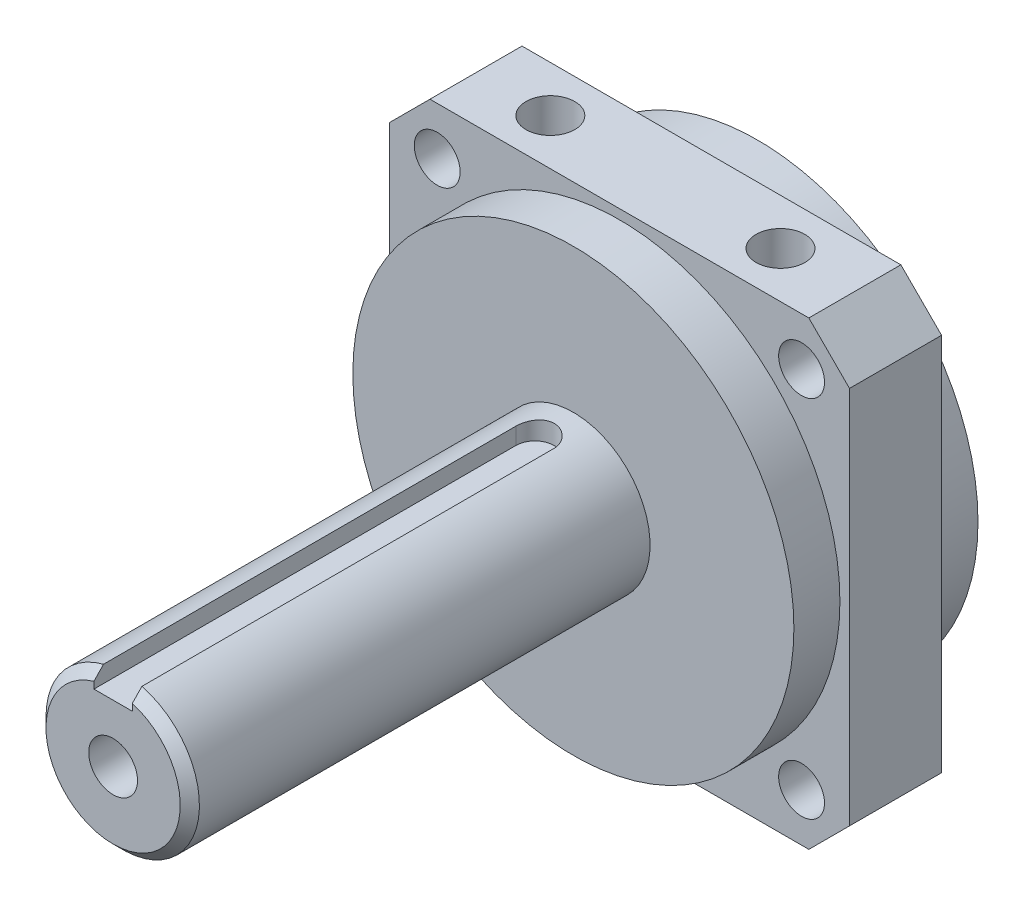
ISO-10303-21;
HEADER;
FILE_DESCRIPTION(('STEP AP214'),'2;1');
FILE_NAME('part.step','',(''),(''),'','','');
FILE_SCHEMA(('AUTOMOTIVE_DESIGN { 1 0 10303 214 1 1 1 1 }'));
ENDSEC;
DATA;
#1=APPLICATION_CONTEXT('core data for automotive mechanical design processes');
#2=APPLICATION_PROTOCOL_DEFINITION('international standard','automotive_design',2000,#1);
#3=PRODUCT_CONTEXT('',#1,'mechanical');
#4=PRODUCT('Part','Part','',(#3));
#5=PRODUCT_RELATED_PRODUCT_CATEGORY('part','',(#4));
#6=PRODUCT_DEFINITION_FORMATION('','',#4);
#7=PRODUCT_DEFINITION_CONTEXT('part definition',#1,'design');
#8=PRODUCT_DEFINITION('design','',#6,#7);
#9=PRODUCT_DEFINITION_SHAPE('','',#8);
#10=(LENGTH_UNIT() NAMED_UNIT(*) SI_UNIT(.MILLI.,.METRE.));
#11=(NAMED_UNIT(*) PLANE_ANGLE_UNIT() SI_UNIT($,.RADIAN.));
#12=(NAMED_UNIT(*) SI_UNIT($,.STERADIAN.) SOLID_ANGLE_UNIT());
#13=UNCERTAINTY_MEASURE_WITH_UNIT(LENGTH_MEASURE(1.E-05),#10,'distance_accuracy_value','');
#14=(GEOMETRIC_REPRESENTATION_CONTEXT(3) GLOBAL_UNCERTAINTY_ASSIGNED_CONTEXT((#13)) GLOBAL_UNIT_ASSIGNED_CONTEXT((#10,
#11,#12)) REPRESENTATION_CONTEXT('',''));
#15=CARTESIAN_POINT('',(0.,0.,0.));
#16=DIRECTION('',(0.,0.,1.));
#17=DIRECTION('',(1.,0.,0.));
#18=AXIS2_PLACEMENT_3D('',#15,#16,#17);
#19=CARTESIAN_POINT('',(0.,0.,28.1939999999281));
#20=DIRECTION('',(0.,0.,1.));
#21=DIRECTION('',(1.,0.,0.));
#22=AXIS2_PLACEMENT_3D('',#19,#20,#21);
#23=CONICAL_SURFACE('',#22,2.0192999998585,1.02974425866781);
#24=CARTESIAN_POINT('',(0.,0.,26.9806821519865));
#25=VERTEX_POINT('',#24);
#26=VERTEX_LOOP('',#25);
#27=FACE_BOUND('',#26,.T.);
#28=CARTESIAN_POINT('',(0.,0.,28.194));
#29=DIRECTION('',(0.,0.,1.));
#30=DIRECTION('',(1.,0.,0.));
#31=AXIS2_PLACEMENT_3D('',#28,#29,#30);
#32=CIRCLE('',#31,2.01929999999999);
#33=CARTESIAN_POINT('',(2.01929999999999,0.,28.194));
#34=VERTEX_POINT('',#33);
#35=EDGE_CURVE('E341',#34,#34,#32,.T.);
#36=ORIENTED_EDGE('',*,*,#35,.T.);
#37=EDGE_LOOP('',(#36));
#38=FACE_BOUND('',#37,.T.);
#39=ADVANCED_FACE('F16',(#27,#38),#23,.F.);
#40=CARTESIAN_POINT('',(0.,0.,38.1));
#41=DIRECTION('',(0.,0.,1.));
#42=DIRECTION('',(1.,0.,0.));
#43=AXIS2_PLACEMENT_3D('',#40,#41,#42);
#44=CYLINDRICAL_SURFACE('',#43,2.01929999999999);
#45=CARTESIAN_POINT('',(0.,0.,38.1));
#46=DIRECTION('',(0.,0.,1.));
#47=DIRECTION('',(1.,0.,0.));
#48=AXIS2_PLACEMENT_3D('',#45,#46,#47);
#49=CIRCLE('',#48,2.01929999999999);
#50=CARTESIAN_POINT('',(2.01929999999999,0.,38.1));
#51=VERTEX_POINT('',#50);
#52=EDGE_CURVE('E19',#51,#51,#49,.F.);
#53=ORIENTED_EDGE('',*,*,#52,.F.);
#54=EDGE_LOOP('',(#53));
#55=FACE_BOUND('',#54,.T.);
#56=ORIENTED_EDGE('',*,*,#35,.F.);
#57=EDGE_LOOP('',(#56));
#58=FACE_BOUND('',#57,.T.);
#59=ADVANCED_FACE('F482',(#55,#58),#44,.F.);
#60=CARTESIAN_POINT('',(-1.5875,4.7625,1.58750000000001));
#61=DIRECTION('',(0.,-1.,0.));
#62=DIRECTION('',(0.,0.,-1.));
#63=AXIS2_PLACEMENT_3D('',#60,#61,#62);
#64=PLANE('',#63);
#65=CARTESIAN_POINT('',(0.,4.7625,3.17500000000001));
#66=DIRECTION('',(0.,1.,0.));
#67=DIRECTION('',(-1.,0.,0.));
#68=AXIS2_PLACEMENT_3D('',#65,#66,#67);
#69=CIRCLE('',#68,1.5875);
#70=CARTESIAN_POINT('',(1.5875,4.7625,3.17500000000001));
#71=VERTEX_POINT('',#70);
#72=CARTESIAN_POINT('',(-1.5875,4.7625,3.17500000000001));
#73=VERTEX_POINT('',#72);
#74=EDGE_CURVE('E147',#71,#73,#69,.T.);
#75=ORIENTED_EDGE('',*,*,#74,.T.);
#76=DIRECTION('',(0.,0.,1.));
#77=VECTOR('',#76,1.);
#78=CARTESIAN_POINT('',(-1.5875,4.7625,1.58750000000001));
#79=LINE('',#78,#77);
#80=CARTESIAN_POINT('',(-1.5875,4.7625,38.1));
#81=VERTEX_POINT('',#80);
#82=EDGE_CURVE('E141',#73,#81,#79,.T.);
#83=ORIENTED_EDGE('',*,*,#82,.T.);
#84=DIRECTION('',(1.,0.,0.));
#85=VECTOR('',#84,1.);
#86=CARTESIAN_POINT('',(0.,4.7625,38.1));
#87=LINE('',#86,#85);
#88=CARTESIAN_POINT('',(1.5875,4.7625,38.1));
#89=VERTEX_POINT('',#88);
#90=EDGE_CURVE('E138',#89,#81,#87,.F.);
#91=ORIENTED_EDGE('',*,*,#90,.F.);
#92=DIRECTION('',(0.,0.,1.));
#93=VECTOR('',#92,1.);
#94=CARTESIAN_POINT('',(1.5875,4.7625,1.58750000000001));
#95=LINE('',#94,#93);
#96=EDGE_CURVE('E351',#89,#71,#95,.F.);
#97=ORIENTED_EDGE('',*,*,#96,.T.);
#98=EDGE_LOOP('',(#75,#83,#91,#97));
#99=FACE_BOUND('',#98,.T.);
#100=ADVANCED_FACE('F479',(#99),#64,.F.);
#101=CARTESIAN_POINT('',(0.,0.,38.1));
#102=DIRECTION('',(0.,0.,1.));
#103=DIRECTION('',(1.,0.,0.));
#104=AXIS2_PLACEMENT_3D('',#101,#102,#103);
#105=PLANE('',#104);
#106=DIRECTION('',(0.,1.,0.));
#107=VECTOR('',#106,1.);
#108=CARTESIAN_POINT('',(1.5875,7.9375,38.1));
#109=LINE('',#108,#107);
#110=CARTESIAN_POINT('',(1.5875,5.32463687136984,38.1000000000189));
#111=VERTEX_POINT('',#110);
#112=EDGE_CURVE('E131',#111,#89,#109,.F.);
#113=ORIENTED_EDGE('',*,*,#112,.T.);
#114=ORIENTED_EDGE('',*,*,#90,.T.);
#115=DIRECTION('',(0.,-1.,0.));
#116=VECTOR('',#115,1.);
#117=CARTESIAN_POINT('',(-1.5875,7.9375,38.1));
#118=LINE('',#117,#116);
#119=CARTESIAN_POINT('',(-1.5875,5.32463687136732,38.1000000000213));
#120=VERTEX_POINT('',#119);
#121=EDGE_CURVE('E135',#81,#120,#118,.F.);
#122=ORIENTED_EDGE('',*,*,#121,.T.);
#123=CARTESIAN_POINT('',(0.,0.,38.1000000000427));
#124=DIRECTION('',(0.,0.,-1.));
#125=DIRECTION('',(-1.,0.,0.));
#126=AXIS2_PLACEMENT_3D('',#123,#124,#125);
#127=CIRCLE('',#126,5.55624999992688);
#128=EDGE_CURVE('E119',#111,#120,#127,.T.);
#129=ORIENTED_EDGE('',*,*,#128,.F.);
#130=EDGE_LOOP('',(#113,#114,#122,#129));
#131=FACE_BOUND('',#130,.T.);
#132=ORIENTED_EDGE('',*,*,#52,.T.);
#133=EDGE_LOOP('',(#132));
#134=FACE_BOUND('',#133,.T.);
#135=ADVANCED_FACE('F136',(#131,#134),#105,.T.);
#136=CARTESIAN_POINT('',(-1.5875,7.9375,1.58750000000001));
#137=DIRECTION('',(-1.,0.,0.));
#138=DIRECTION('',(0.,-1.,0.));
#139=AXIS2_PLACEMENT_3D('',#136,#137,#138);
#140=PLANE('',#139);
#141=CARTESIAN_POINT('',(-1.5875,5.32463687139379,38.099999999996));
#142=CARTESIAN_POINT('',(-1.5875,5.46226335409388,37.9680602268335));
#143=CARTESIAN_POINT('',(-1.5875,5.5997202855016,37.8359444996539));
#144=CARTESIAN_POINT('',(-1.5875,5.87429501565907,37.5713611662396));
#145=CARTESIAN_POINT('',(-1.5875,6.01141281448309,37.4388935600819));
#146=CARTESIAN_POINT('',(-1.5875,6.14836106208903,37.3062499999843));
#147=B_SPLINE_CURVE_WITH_KNOTS('',3,(#141,#142,#143,#144,#145,#146),.UNSPECIFIED.,.F.,.F.,(4,2,
4),(0.,0.571962201759809,1.14392427822936),.UNSPECIFIED.);
#148=CARTESIAN_POINT('',(-1.5875,6.14836106209665,37.3062499999922));
#149=VERTEX_POINT('',#148);
#150=EDGE_CURVE('E123',#120,#149,#147,.T.);
#151=ORIENTED_EDGE('',*,*,#150,.F.);
#152=ORIENTED_EDGE('',*,*,#121,.F.);
#153=ORIENTED_EDGE('',*,*,#82,.F.);
#154=DIRECTION('',(0.,-1.,0.));
#155=VECTOR('',#154,1.);
#156=CARTESIAN_POINT('',(-1.5875,0.,3.17500000000001));
#157=LINE('',#156,#155);
#158=CARTESIAN_POINT('',(-1.5875,6.14836106210427,3.17500000000001));
#159=VERTEX_POINT('',#158);
#160=EDGE_CURVE('E146',#73,#159,#157,.F.);
#161=ORIENTED_EDGE('',*,*,#160,.T.);
#162=DIRECTION('',(0.,0.,-1.));
#163=VECTOR('',#162,1.);
#164=CARTESIAN_POINT('',(-1.5875,6.14836106210427,38.1));
#165=LINE('',#164,#163);
#166=EDGE_CURVE('E130',#149,#159,#165,.T.);
#167=ORIENTED_EDGE('',*,*,#166,.F.);
#168=EDGE_LOOP('',(#151,#152,#153,#161,#167));
#169=FACE_BOUND('',#168,.T.);
#170=ADVANCED_FACE('F143',(#169),#140,.F.);
#171=CARTESIAN_POINT('',(0.,0.,3.17500000000001));
#172=DIRECTION('',(0.,1.,0.));
#173=DIRECTION('',(-1.,0.,0.));
#174=AXIS2_PLACEMENT_3D('',#171,#172,#173);
#175=CYLINDRICAL_SURFACE('',#174,1.5875);
#176=DIRECTION('',(0.,1.,0.));
#177=VECTOR('',#176,1.);
#178=CARTESIAN_POINT('',(1.5875,7.9375,3.17500000000001));
#179=LINE('',#178,#177);
#180=CARTESIAN_POINT('',(1.5875,6.14836106210428,3.17500000000001));
#181=VERTEX_POINT('',#180);
#182=EDGE_CURVE('E174',#71,#181,#179,.T.);
#183=ORIENTED_EDGE('',*,*,#182,.T.);
#184=CARTESIAN_POINT('',(-1.5875,6.14836106210427,3.17500000000002));
#185=CARTESIAN_POINT('',(-1.5875005347221,6.14835810868573,3.13108504800574));
#186=CARTESIAN_POINT('',(-1.58567661174546,6.1488321571389,3.08719185612077));
#187=CARTESIAN_POINT('',(-1.57840569717735,6.15070373440419,2.99973374007765));
#188=CARTESIAN_POINT('',(-1.57295931521448,6.15210110782842,2.95616876193135));
#189=CARTESIAN_POINT('',(-1.55126572658893,6.1576221525004,2.82661823019265));
#190=CARTESIAN_POINT('',(-1.5296637296004,6.16307509376748,2.74152292592806));
#191=CARTESIAN_POINT('',(-1.47287895457943,6.17688995608206,2.5763131201806));
#192=CARTESIAN_POINT('',(-1.43769722409702,6.18525165274125,2.4961982350581));
#193=CARTESIAN_POINT('',(-1.35479517756304,6.20393662510198,2.34297047529258));
#194=CARTESIAN_POINT('',(-1.30707194181757,6.21426035741522,2.26985923653114));
#195=CARTESIAN_POINT('',(-1.1993371670561,6.23595707887749,2.13115606527995));
#196=CARTESIAN_POINT('',(-1.13910300733152,6.24734667388768,2.06573970062098));
#197=CARTESIAN_POINT('',(-1.00851371119878,6.26975132963679,1.94580623088578));
#198=CARTESIAN_POINT('',(-0.938154957437526,6.28076625476574,1.8912930380437));
#199=CARTESIAN_POINT('',(-0.78808953580411,6.30136714833112,1.79399185375318));
#200=CARTESIAN_POINT('',(-0.708263180753414,6.31093033514495,1.75138340439519));
#201=CARTESIAN_POINT('',(-0.542357177260244,6.32734283789911,1.6802996564682));
#202=CARTESIAN_POINT('',(-0.456285166695517,6.33419540463604,1.65180741816498));
#203=CARTESIAN_POINT('',(-0.308152380307649,6.34280690605921,1.61646213932074));
#204=CARTESIAN_POINT('',(-0.247067257357066,6.34549035539136,1.60562005304944));
#205=CARTESIAN_POINT('',(-0.123996454410237,6.3490876888745,1.59113769145861));
#206=CARTESIAN_POINT('',(-0.0620107875572763,6.35000159882553,1.58749731113757));
#207=CARTESIAN_POINT('',(0.0876803967486354,6.34999773933436,1.58750380192762));
#208=CARTESIAN_POINT('',(0.175411016460152,6.34816513335973,1.594791067172));
#209=CARTESIAN_POINT('',(0.348380525034637,6.34102879138945,1.62371289354695));
#210=CARTESIAN_POINT('',(0.433616958406108,6.33572174751383,1.64536112746986));
#211=CARTESIAN_POINT('',(0.599040292949523,6.32222512421158,1.70226580793548));
#212=CARTESIAN_POINT('',(0.679233912557768,6.3140394800964,1.7375036825137));
#213=CARTESIAN_POINT('',(0.832565934999531,6.29565763049597,1.82052815492061));
#214=CARTESIAN_POINT('',(0.905704517218626,6.28546147615122,1.86831443357106));
#215=CARTESIAN_POINT('',(1.04436365780342,6.26393038121457,1.97611942379249));
#216=CARTESIAN_POINT('',(1.10971829889362,6.25257786624043,2.03634803202077));
#217=CARTESIAN_POINT('',(1.22951519838159,6.2301296384948,2.16688424756393));
#218=CARTESIAN_POINT('',(1.28395571935549,6.21903396685861,2.23719345656366));
#219=CARTESIAN_POINT('',(1.38116725538388,6.19817668389332,2.38719176796676));
#220=CARTESIAN_POINT('',(1.42374920363026,6.18843780250452,2.46700671760337));
#221=CARTESIAN_POINT('',(1.49480507045921,6.17166094046039,2.63292689704295));
#222=CARTESIAN_POINT('',(1.52328958149317,6.16462093284005,2.71902734809052));
#223=CARTESIAN_POINT('',(1.55859647860432,6.15576956135878,2.86715803226458));
#224=CARTESIAN_POINT('',(1.5694184144922,6.15300921691422,2.92820781192755));
#225=CARTESIAN_POINT('',(1.58387467718142,6.14929718216966,3.05116074651233));
#226=CARTESIAN_POINT('',(1.58751418051883,6.14834418929123,3.11306325442812));
#227=CARTESIAN_POINT('',(1.5875,6.14836106210428,3.17500000000001));
#228=B_SPLINE_CURVE_WITH_KNOTS('',3,(#184,#185,#186,#187,#188,#189,#190,#191,#192,#193,#194,
#195,#196,#197,#198,#199,#200,#201,#202,#203,#204,#205,#206,#207,#208,#209,#210,#211,#212,#213,
#214,#215,#216,#217,#218,#219,#220,#221,#222,#223,#224,#225,#226,#227),.UNSPECIFIED.,.F.,.F.,(4,
2,2,2,2,2,2,2,2,2,2,2,2,2,2,2,2,2,2,2,2,4),(0.,0.131661631551339,0.26330111119063,
0.525827565802087,0.788333772987209,1.05090114649685,1.31861744482507,1.58642963242961,
1.85808613315677,2.12941584627081,2.31528840630699,2.50115825628429,2.76396966106715,
3.02703164315824,3.28973538447958,3.5524324443777,3.81998818241836,4.08758647901983,
4.35923443864542,4.63067797793238,4.81644389573702,5.00207587901888),.UNSPECIFIED.);
#229=EDGE_CURVE('E176',#159,#181,#228,.T.);
#230=ORIENTED_EDGE('',*,*,#229,.F.);
#231=ORIENTED_EDGE('',*,*,#160,.F.);
#232=ORIENTED_EDGE('',*,*,#74,.F.);
#233=EDGE_LOOP('',(#183,#230,#231,#232));
#234=FACE_BOUND('',#233,.T.);
#235=ADVANCED_FACE('F186',(#234),#175,.F.);
#236=CARTESIAN_POINT('',(1.5875,7.9375,1.58750000000001));
#237=DIRECTION('',(1.,0.,0.));
#238=DIRECTION('',(0.,1.,0.));
#239=AXIS2_PLACEMENT_3D('',#236,#237,#238);
#240=PLANE('',#239);
#241=CARTESIAN_POINT('',(1.5875,6.14836106208903,37.3062499999843));
#242=CARTESIAN_POINT('',(1.5875,6.01141281448322,37.4388935600818));
#243=CARTESIAN_POINT('',(1.5875,5.87429501565934,37.5713611662393));
#244=CARTESIAN_POINT('',(1.5875,5.59972028550214,37.8359444996534));
#245=CARTESIAN_POINT('',(1.5875,5.46226335409455,37.9680602268328));
#246=CARTESIAN_POINT('',(1.5875,5.3246368713946,38.0999999999952));
#247=B_SPLINE_CURVE_WITH_KNOTS('',3,(#241,#242,#243,#244,#245,#246),.UNSPECIFIED.,.F.,.F.,(4,2,
4),(0.,0.571962076468992,1.14392427822824),.UNSPECIFIED.);
#248=CARTESIAN_POINT('',(1.5875,6.14836106209665,37.3062499999922));
#249=VERTEX_POINT('',#248);
#250=EDGE_CURVE('E126',#249,#111,#247,.T.);
#251=ORIENTED_EDGE('',*,*,#250,.F.);
#252=DIRECTION('',(0.,0.,-1.));
#253=VECTOR('',#252,1.);
#254=CARTESIAN_POINT('',(1.5875,6.14836106210428,38.1));
#255=LINE('',#254,#253);
#256=EDGE_CURVE('E183',#181,#249,#255,.F.);
#257=ORIENTED_EDGE('',*,*,#256,.F.);
#258=ORIENTED_EDGE('',*,*,#182,.F.);
#259=ORIENTED_EDGE('',*,*,#96,.F.);
#260=ORIENTED_EDGE('',*,*,#112,.F.);
#261=EDGE_LOOP('',(#251,#257,#258,#259,#260));
#262=FACE_BOUND('',#261,.T.);
#263=ADVANCED_FACE('F165',(#262),#240,.F.);
#264=CARTESIAN_POINT('',(0.,0.,37.3062500001424));
#265=DIRECTION('',(0.,0.,-1.));
#266=DIRECTION('',(-1.,0.,0.));
#267=AXIS2_PLACEMENT_3D('',#264,#265,#266);
#268=CONICAL_SURFACE('',#267,6.34999999982711,0.785398163397448);
#269=ORIENTED_EDGE('',*,*,#128,.T.);
#270=ORIENTED_EDGE('',*,*,#150,.T.);
#271=CARTESIAN_POINT('',(0.,0.,37.30625));
#272=DIRECTION('',(0.,0.,-1.));
#273=DIRECTION('',(-1.,0.,0.));
#274=AXIS2_PLACEMENT_3D('',#271,#272,#273);
#275=CIRCLE('',#274,6.35);
#276=EDGE_CURVE('E298',#249,#149,#275,.T.);
#277=ORIENTED_EDGE('',*,*,#276,.F.);
#278=ORIENTED_EDGE('',*,*,#250,.T.);
#279=EDGE_LOOP('',(#269,#270,#277,#278));
#280=FACE_BOUND('',#279,.T.);
#281=ADVANCED_FACE('F121',(#280),#268,.T.);
#282=CARTESIAN_POINT('',(0.,0.,38.1));
#283=DIRECTION('',(0.,0.,-1.));
#284=DIRECTION('',(-1.,0.,0.));
#285=AXIS2_PLACEMENT_3D('',#282,#283,#284);
#286=CYLINDRICAL_SURFACE('',#285,6.35);
#287=ORIENTED_EDGE('',*,*,#256,.T.);
#288=ORIENTED_EDGE('',*,*,#276,.T.);
#289=ORIENTED_EDGE('',*,*,#166,.T.);
#290=ORIENTED_EDGE('',*,*,#229,.T.);
#291=EDGE_LOOP('',(#287,#288,#289,#290));
#292=FACE_BOUND('',#291,.T.);
#293=CARTESIAN_POINT('',(0.,0.,0.));
#294=DIRECTION('',(0.,0.,-1.));
#295=DIRECTION('',(-1.,0.,0.));
#296=AXIS2_PLACEMENT_3D('',#293,#294,#295);
#297=CIRCLE('',#296,6.35);
#298=CARTESIAN_POINT('',(-6.35,0.,0.));
#299=VERTEX_POINT('',#298);
#300=EDGE_CURVE('E184',#299,#299,#297,.F.);
#301=ORIENTED_EDGE('',*,*,#300,.T.);
#302=EDGE_LOOP('',(#301));
#303=FACE_BOUND('',#302,.T.);
#304=ADVANCED_FACE('F164',(#292,#303),#286,.T.);
#305=CARTESIAN_POINT('',(0.,0.,0.));
#306=DIRECTION('',(0.,0.,-1.));
#307=DIRECTION('',(-1.,0.,0.));
#308=AXIS2_PLACEMENT_3D('',#305,#306,#307);
#309=PLANE('',#308);
#310=ORIENTED_EDGE('',*,*,#300,.F.);
#311=EDGE_LOOP('',(#310));
#312=FACE_BOUND('',#311,.T.);
#313=CARTESIAN_POINT('',(0.,0.,0.));
#314=DIRECTION('',(0.,0.,1.));
#315=DIRECTION('',(1.,0.,0.));
#316=AXIS2_PLACEMENT_3D('',#313,#314,#315);
#317=CIRCLE('',#316,18.25625);
#318=CARTESIAN_POINT('',(18.25625,0.,0.));
#319=VERTEX_POINT('',#318);
#320=EDGE_CURVE('E293',#319,#319,#317,.F.);
#321=ORIENTED_EDGE('',*,*,#320,.F.);
#322=EDGE_LOOP('',(#321));
#323=FACE_BOUND('',#322,.T.);
#324=ADVANCED_FACE('F280',(#312,#323),#309,.F.);
#325=CARTESIAN_POINT('',(9.525,11.4300000000185,-7.62));
#326=DIRECTION('',(0.,1.,0.));
#327=DIRECTION('',(0.,0.,1.));
#328=AXIS2_PLACEMENT_3D('',#325,#326,#327);
#329=CONICAL_SURFACE('',#328,2.01930000005461,1.02974425868441);
#330=CARTESIAN_POINT('',(9.525,10.2166821519916,-7.62000000005684));
#331=VERTEX_POINT('',#330);
#332=VERTEX_LOOP('',#331);
#333=FACE_BOUND('',#332,.T.);
#334=CARTESIAN_POINT('',(9.525,11.43,-7.62));
#335=DIRECTION('',(0.,1.,0.));
#336=DIRECTION('',(0.,0.,1.));
#337=AXIS2_PLACEMENT_3D('',#334,#335,#336);
#338=CIRCLE('',#337,2.01929999999999);
#339=CARTESIAN_POINT('',(9.525,11.43,-5.60070000000001));
#340=VERTEX_POINT('',#339);
#341=EDGE_CURVE('E294',#340,#340,#338,.T.);
#342=ORIENTED_EDGE('',*,*,#341,.T.);
#343=EDGE_LOOP('',(#342));
#344=FACE_BOUND('',#343,.T.);
#345=ADVANCED_FACE('F277',(#333,#344),#329,.F.);
#346=CARTESIAN_POINT('',(-9.525,11.4300000000753,-7.62));
#347=DIRECTION('',(0.,1.,0.));
#348=DIRECTION('',(0.,0.,1.));
#349=AXIS2_PLACEMENT_3D('',#346,#347,#348);
#350=CONICAL_SURFACE('',#349,2.01930000011145,1.02974425867615);
#351=CARTESIAN_POINT('',(-9.525,10.2166821519916,-7.62000000005969));
#352=VERTEX_POINT('',#351);
#353=VERTEX_LOOP('',#352);
#354=FACE_BOUND('',#353,.T.);
#355=CARTESIAN_POINT('',(-9.525,11.43,-7.62));
#356=DIRECTION('',(0.,1.,0.));
#357=DIRECTION('',(0.,0.,1.));
#358=AXIS2_PLACEMENT_3D('',#355,#356,#357);
#359=CIRCLE('',#358,2.01929999999999);
#360=CARTESIAN_POINT('',(-9.525,11.43,-5.60070000000001));
#361=VERTEX_POINT('',#360);
#362=EDGE_CURVE('E296',#361,#361,#359,.T.);
#363=ORIENTED_EDGE('',*,*,#362,.T.);
#364=EDGE_LOOP('',(#363));
#365=FACE_BOUND('',#364,.T.);
#366=ADVANCED_FACE('F273',(#354,#365),#350,.F.);
#367=CARTESIAN_POINT('',(0.,0.,-3.81));
#368=DIRECTION('',(0.,0.,1.));
#369=DIRECTION('',(1.,0.,0.));
#370=AXIS2_PLACEMENT_3D('',#367,#368,#369);
#371=CYLINDRICAL_SURFACE('',#370,18.25625);
#372=ORIENTED_EDGE('',*,*,#320,.T.);
#373=EDGE_LOOP('',(#372));
#374=FACE_BOUND('',#373,.T.);
#375=CARTESIAN_POINT('',(0.,0.,-3.81));
#376=DIRECTION('',(0.,0.,1.));
#377=DIRECTION('',(1.,0.,0.));
#378=AXIS2_PLACEMENT_3D('',#375,#376,#377);
#379=CIRCLE('',#378,18.25625);
#380=CARTESIAN_POINT('',(18.25625,0.,-3.81));
#381=VERTEX_POINT('',#380);
#382=EDGE_CURVE('E300',#381,#381,#379,.T.);
#383=ORIENTED_EDGE('',*,*,#382,.T.);
#384=EDGE_LOOP('',(#383));
#385=FACE_BOUND('',#384,.T.);
#386=ADVANCED_FACE('F269',(#374,#385),#371,.T.);
#387=CARTESIAN_POINT('',(9.525,19.05,-7.62));
#388=DIRECTION('',(0.,1.,0.));
#389=DIRECTION('',(0.,0.,1.));
#390=AXIS2_PLACEMENT_3D('',#387,#388,#389);
#391=CYLINDRICAL_SURFACE('',#390,2.01929999999999);
#392=CARTESIAN_POINT('',(9.525,19.05,-7.62));
#393=DIRECTION('',(0.,1.,0.));
#394=DIRECTION('',(0.,0.,1.));
#395=AXIS2_PLACEMENT_3D('',#392,#393,#394);
#396=CIRCLE('',#395,2.01929999999999);
#397=CARTESIAN_POINT('',(9.525,19.05,-5.60070000000001));
#398=VERTEX_POINT('',#397);
#399=EDGE_CURVE('E316',#398,#398,#396,.F.);
#400=ORIENTED_EDGE('',*,*,#399,.F.);
#401=EDGE_LOOP('',(#400));
#402=FACE_BOUND('',#401,.T.);
#403=ORIENTED_EDGE('',*,*,#341,.F.);
#404=EDGE_LOOP('',(#403));
#405=FACE_BOUND('',#404,.T.);
#406=ADVANCED_FACE('F265',(#402,#405),#391,.F.);
#407=CARTESIAN_POINT('',(-9.525,19.05,-7.62));
#408=DIRECTION('',(0.,1.,0.));
#409=DIRECTION('',(0.,0.,1.));
#410=AXIS2_PLACEMENT_3D('',#407,#408,#409);
#411=CYLINDRICAL_SURFACE('',#410,2.01929999999999);
#412=CARTESIAN_POINT('',(-9.525,19.05,-7.62));
#413=DIRECTION('',(0.,1.,0.));
#414=DIRECTION('',(0.,0.,1.));
#415=AXIS2_PLACEMENT_3D('',#412,#413,#414);
#416=CIRCLE('',#415,2.01929999999999);
#417=CARTESIAN_POINT('',(-9.525,19.05,-5.60070000000001));
#418=VERTEX_POINT('',#417);
#419=EDGE_CURVE('E319',#418,#418,#416,.F.);
#420=ORIENTED_EDGE('',*,*,#419,.F.);
#421=EDGE_LOOP('',(#420));
#422=FACE_BOUND('',#421,.T.);
#423=ORIENTED_EDGE('',*,*,#362,.F.);
#424=EDGE_LOOP('',(#423));
#425=FACE_BOUND('',#424,.T.);
#426=ADVANCED_FACE('F261',(#422,#425),#411,.F.);
#427=CARTESIAN_POINT('',(0.,0.,-3.81));
#428=DIRECTION('',(0.,0.,-1.));
#429=DIRECTION('',(-1.,0.,0.));
#430=AXIS2_PLACEMENT_3D('',#427,#428,#429);
#431=PLANE('',#430);
#432=DIRECTION('',(1.,0.,0.));
#433=VECTOR('',#432,1.);
#434=CARTESIAN_POINT('',(-19.05,-19.05,-3.81));
#435=LINE('',#434,#433);
#436=CARTESIAN_POINT('',(15.6824039545991,-19.05,-3.81));
#437=VERTEX_POINT('',#436);
#438=CARTESIAN_POINT('',(-15.6824039545991,-19.05,-3.81));
#439=VERTEX_POINT('',#438);
#440=EDGE_CURVE('E315',#437,#439,#435,.F.);
#441=ORIENTED_EDGE('',*,*,#440,.F.);
#442=DIRECTION('',(-0.707106781186543,-0.707106781186552,0.));
#443=VECTOR('',#442,1.);
#444=CARTESIAN_POINT('',(19.05,-15.682403954599,-3.81));
#445=LINE('',#444,#443);
#446=CARTESIAN_POINT('',(19.05,-15.682403954599,-3.81));
#447=VERTEX_POINT('',#446);
#448=EDGE_CURVE('E372',#437,#447,#445,.F.);
#449=ORIENTED_EDGE('',*,*,#448,.T.);
#450=DIRECTION('',(0.,1.,0.));
#451=VECTOR('',#450,1.);
#452=CARTESIAN_POINT('',(19.05,-19.05,-3.81));
#453=LINE('',#452,#451);
#454=CARTESIAN_POINT('',(19.05,15.682403954599,-3.81));
#455=VERTEX_POINT('',#454);
#456=EDGE_CURVE('E377',#455,#447,#453,.F.);
#457=ORIENTED_EDGE('',*,*,#456,.F.);
#458=DIRECTION('',(-0.707106781186543,0.707106781186552,0.));
#459=VECTOR('',#458,1.);
#460=CARTESIAN_POINT('',(19.05,15.682403954599,-3.81));
#461=LINE('',#460,#459);
#462=CARTESIAN_POINT('',(15.6824039545991,19.05,-3.81));
#463=VERTEX_POINT('',#462);
#464=EDGE_CURVE('E380',#463,#455,#461,.F.);
#465=ORIENTED_EDGE('',*,*,#464,.F.);
#466=DIRECTION('',(1.,0.,0.));
#467=VECTOR('',#466,1.);
#468=CARTESIAN_POINT('',(-19.05,19.05,-3.81));
#469=LINE('',#468,#467);
#470=CARTESIAN_POINT('',(-15.6824039545991,19.05,-3.81));
#471=VERTEX_POINT('',#470);
#472=EDGE_CURVE('E323',#471,#463,#469,.T.);
#473=ORIENTED_EDGE('',*,*,#472,.F.);
#474=DIRECTION('',(0.707106781186543,0.707106781186552,0.));
#475=VECTOR('',#474,1.);
#476=CARTESIAN_POINT('',(-19.05,15.682403954599,-3.81));
#477=LINE('',#476,#475);
#478=CARTESIAN_POINT('',(-19.05,15.682403954599,-3.81));
#479=VERTEX_POINT('',#478);
#480=EDGE_CURVE('E393',#471,#479,#477,.F.);
#481=ORIENTED_EDGE('',*,*,#480,.T.);
#482=DIRECTION('',(0.,1.,0.));
#483=VECTOR('',#482,1.);
#484=CARTESIAN_POINT('',(-19.05,-19.05,-3.81));
#485=LINE('',#484,#483);
#486=CARTESIAN_POINT('',(-19.05,-15.682403954599,-3.81));
#487=VERTEX_POINT('',#486);
#488=EDGE_CURVE('E395',#487,#479,#485,.T.);
#489=ORIENTED_EDGE('',*,*,#488,.F.);
#490=DIRECTION('',(0.707106781186543,-0.707106781186552,0.));
#491=VECTOR('',#490,1.);
#492=CARTESIAN_POINT('',(-19.05,-15.682403954599,-3.81));
#493=LINE('',#492,#491);
#494=EDGE_CURVE('E403',#439,#487,#493,.F.);
#495=ORIENTED_EDGE('',*,*,#494,.F.);
#496=EDGE_LOOP('',(#441,#449,#457,#465,#473,#481,#489,#495));
#497=FACE_BOUND('',#496,.T.);
#498=ORIENTED_EDGE('',*,*,#382,.F.);
#499=EDGE_LOOP('',(#498));
#500=FACE_BOUND('',#499,.T.);
#501=CARTESIAN_POINT('',(15.08125,-15.08125,-3.81));
#502=DIRECTION('',(0.,0.,1.));
#503=DIRECTION('',(1.,0.,0.));
#504=AXIS2_PLACEMENT_3D('',#501,#502,#503);
#505=CIRCLE('',#504,1.89864999999999);
#506=CARTESIAN_POINT('',(16.9799,-15.08125,-3.81));
#507=VERTEX_POINT('',#506);
#508=EDGE_CURVE('E312',#507,#507,#505,.F.);
#509=ORIENTED_EDGE('',*,*,#508,.T.);
#510=EDGE_LOOP('',(#509));
#511=FACE_BOUND('',#510,.T.);
#512=CARTESIAN_POINT('',(-15.08125,-15.08125,-3.81));
#513=DIRECTION('',(0.,0.,1.));
#514=DIRECTION('',(1.,0.,0.));
#515=AXIS2_PLACEMENT_3D('',#512,#513,#514);
#516=CIRCLE('',#515,1.89865);
#517=CARTESIAN_POINT('',(-13.1826,-15.08125,-3.81));
#518=VERTEX_POINT('',#517);
#519=EDGE_CURVE('E309',#518,#518,#516,.F.);
#520=ORIENTED_EDGE('',*,*,#519,.T.);
#521=EDGE_LOOP('',(#520));
#522=FACE_BOUND('',#521,.T.);
#523=CARTESIAN_POINT('',(15.08125,15.08125,-3.81));
#524=DIRECTION('',(0.,0.,1.));
#525=DIRECTION('',(1.,0.,0.));
#526=AXIS2_PLACEMENT_3D('',#523,#524,#525);
#527=CIRCLE('',#526,1.89865);
#528=CARTESIAN_POINT('',(16.9799,15.08125,-3.81));
#529=VERTEX_POINT('',#528);
#530=EDGE_CURVE('E306',#529,#529,#527,.F.);
#531=ORIENTED_EDGE('',*,*,#530,.T.);
#532=EDGE_LOOP('',(#531));
#533=FACE_BOUND('',#532,.T.);
#534=CARTESIAN_POINT('',(-15.08125,15.08125,-3.81));
#535=DIRECTION('',(0.,0.,1.));
#536=DIRECTION('',(1.,0.,0.));
#537=AXIS2_PLACEMENT_3D('',#534,#535,#536);
#538=CIRCLE('',#537,1.89865);
#539=CARTESIAN_POINT('',(-13.1826,15.08125,-3.81));
#540=VERTEX_POINT('',#539);
#541=EDGE_CURVE('E303',#540,#540,#538,.F.);
#542=ORIENTED_EDGE('',*,*,#541,.T.);
#543=EDGE_LOOP('',(#542));
#544=FACE_BOUND('',#543,.T.);
#545=ADVANCED_FACE('F257',(#497,#500,#511,#522,#533,#544),#431,.F.);
#546=CARTESIAN_POINT('',(-15.08125,15.08125,-3.81));
#547=DIRECTION('',(0.,0.,1.));
#548=DIRECTION('',(1.,0.,0.));
#549=AXIS2_PLACEMENT_3D('',#546,#547,#548);
#550=CYLINDRICAL_SURFACE('',#549,1.89865);
#551=CARTESIAN_POINT('',(-15.08125,15.08125,-11.43));
#552=DIRECTION('',(0.,0.,1.));
#553=DIRECTION('',(1.,0.,0.));
#554=AXIS2_PLACEMENT_3D('',#551,#552,#553);
#555=CIRCLE('',#554,1.89865);
#556=CARTESIAN_POINT('',(-13.1826,15.08125,-11.43));
#557=VERTEX_POINT('',#556);
#558=EDGE_CURVE('E324',#557,#557,#555,.F.);
#559=ORIENTED_EDGE('',*,*,#558,.T.);
#560=EDGE_LOOP('',(#559));
#561=FACE_BOUND('',#560,.T.);
#562=ORIENTED_EDGE('',*,*,#541,.F.);
#563=EDGE_LOOP('',(#562));
#564=FACE_BOUND('',#563,.T.);
#565=ADVANCED_FACE('F253',(#561,#564),#550,.F.);
#566=CARTESIAN_POINT('',(15.08125,15.08125,-3.81));
#567=DIRECTION('',(0.,0.,1.));
#568=DIRECTION('',(1.,0.,0.));
#569=AXIS2_PLACEMENT_3D('',#566,#567,#568);
#570=CYLINDRICAL_SURFACE('',#569,1.89865);
#571=CARTESIAN_POINT('',(15.08125,15.08125,-11.43));
#572=DIRECTION('',(0.,0.,1.));
#573=DIRECTION('',(1.,0.,0.));
#574=AXIS2_PLACEMENT_3D('',#571,#572,#573);
#575=CIRCLE('',#574,1.89865);
#576=CARTESIAN_POINT('',(16.9799,15.08125,-11.43));
#577=VERTEX_POINT('',#576);
#578=EDGE_CURVE('E327',#577,#577,#575,.F.);
#579=ORIENTED_EDGE('',*,*,#578,.T.);
#580=EDGE_LOOP('',(#579));
#581=FACE_BOUND('',#580,.T.);
#582=ORIENTED_EDGE('',*,*,#530,.F.);
#583=EDGE_LOOP('',(#582));
#584=FACE_BOUND('',#583,.T.);
#585=ADVANCED_FACE('F249',(#581,#584),#570,.F.);
#586=CARTESIAN_POINT('',(-15.08125,-15.08125,-3.81));
#587=DIRECTION('',(0.,0.,1.));
#588=DIRECTION('',(1.,0.,0.));
#589=AXIS2_PLACEMENT_3D('',#586,#587,#588);
#590=CYLINDRICAL_SURFACE('',#589,1.89865);
#591=CARTESIAN_POINT('',(-15.08125,-15.08125,-11.43));
#592=DIRECTION('',(0.,0.,1.));
#593=DIRECTION('',(1.,0.,0.));
#594=AXIS2_PLACEMENT_3D('',#591,#592,#593);
#595=CIRCLE('',#594,1.89865);
#596=CARTESIAN_POINT('',(-13.1826,-15.08125,-11.43));
#597=VERTEX_POINT('',#596);
#598=EDGE_CURVE('E331',#597,#597,#595,.F.);
#599=ORIENTED_EDGE('',*,*,#598,.T.);
#600=EDGE_LOOP('',(#599));
#601=FACE_BOUND('',#600,.T.);
#602=ORIENTED_EDGE('',*,*,#519,.F.);
#603=EDGE_LOOP('',(#602));
#604=FACE_BOUND('',#603,.T.);
#605=ADVANCED_FACE('F245',(#601,#604),#590,.F.);
#606=CARTESIAN_POINT('',(15.08125,-15.08125,-3.81));
#607=DIRECTION('',(0.,0.,1.));
#608=DIRECTION('',(1.,0.,0.));
#609=AXIS2_PLACEMENT_3D('',#606,#607,#608);
#610=CYLINDRICAL_SURFACE('',#609,1.89864999999999);
#611=CARTESIAN_POINT('',(15.08125,-15.08125,-11.43));
#612=DIRECTION('',(0.,0.,1.));
#613=DIRECTION('',(1.,0.,0.));
#614=AXIS2_PLACEMENT_3D('',#611,#612,#613);
#615=CIRCLE('',#614,1.89864999999999);
#616=CARTESIAN_POINT('',(16.9799,-15.08125,-11.43));
#617=VERTEX_POINT('',#616);
#618=EDGE_CURVE('E334',#617,#617,#615,.F.);
#619=ORIENTED_EDGE('',*,*,#618,.T.);
#620=EDGE_LOOP('',(#619));
#621=FACE_BOUND('',#620,.T.);
#622=ORIENTED_EDGE('',*,*,#508,.F.);
#623=EDGE_LOOP('',(#622));
#624=FACE_BOUND('',#623,.T.);
#625=ADVANCED_FACE('F241',(#621,#624),#610,.F.);
#626=CARTESIAN_POINT('',(-19.05,-19.05,-15.24));
#627=DIRECTION('',(0.,-1.,0.));
#628=DIRECTION('',(0.,0.,-1.));
#629=AXIS2_PLACEMENT_3D('',#626,#627,#628);
#630=PLANE('',#629);
#631=DIRECTION('',(1.,0.,0.));
#632=VECTOR('',#631,1.);
#633=CARTESIAN_POINT('',(0.,-19.05,-11.43));
#634=LINE('',#633,#632);
#635=CARTESIAN_POINT('',(-15.6824039545991,-19.05,-11.43));
#636=VERTEX_POINT('',#635);
#637=CARTESIAN_POINT('',(15.6824039545991,-19.05,-11.43));
#638=VERTEX_POINT('',#637);
#639=EDGE_CURVE('E337',#636,#638,#634,.T.);
#640=ORIENTED_EDGE('',*,*,#639,.T.);
#641=DIRECTION('',(0.,0.,1.));
#642=VECTOR('',#641,1.);
#643=CARTESIAN_POINT('',(15.6824039545991,-19.05,-15.24));
#644=LINE('',#643,#642);
#645=EDGE_CURVE('E369',#638,#437,#644,.T.);
#646=ORIENTED_EDGE('',*,*,#645,.T.);
#647=ORIENTED_EDGE('',*,*,#440,.T.);
#648=DIRECTION('',(0.,0.,1.));
#649=VECTOR('',#648,1.);
#650=CARTESIAN_POINT('',(-15.6824039545991,-19.05,-15.24));
#651=LINE('',#650,#649);
#652=EDGE_CURVE('E400',#636,#439,#651,.T.);
#653=ORIENTED_EDGE('',*,*,#652,.F.);
#654=EDGE_LOOP('',(#640,#646,#647,#653));
#655=FACE_BOUND('',#654,.T.);
#656=ADVANCED_FACE('F237',(#655),#630,.T.);
#657=CARTESIAN_POINT('',(19.05,-15.682403954599,-15.24));
#658=DIRECTION('',(-0.707106781186552,0.707106781186543,0.));
#659=DIRECTION('',(-0.707106781186543,-0.707106781186552,0.));
#660=AXIS2_PLACEMENT_3D('',#657,#658,#659);
#661=PLANE('',#660);
#662=ORIENTED_EDGE('',*,*,#448,.F.);
#663=ORIENTED_EDGE('',*,*,#645,.F.);
#664=DIRECTION('',(0.707106781186543,0.707106781186552,0.));
#665=VECTOR('',#664,1.);
#666=CARTESIAN_POINT('',(15.6824039545991,-19.05,-11.43));
#667=LINE('',#666,#665);
#668=CARTESIAN_POINT('',(19.05,-15.682403954599,-11.43));
#669=VERTEX_POINT('',#668);
#670=EDGE_CURVE('E408',#638,#669,#667,.T.);
#671=ORIENTED_EDGE('',*,*,#670,.T.);
#672=DIRECTION('',(0.,0.,-1.));
#673=VECTOR('',#672,1.);
#674=CARTESIAN_POINT('',(19.05,-15.682403954599,-15.24));
#675=LINE('',#674,#673);
#676=EDGE_CURVE('E374',#447,#669,#675,.T.);
#677=ORIENTED_EDGE('',*,*,#676,.F.);
#678=EDGE_LOOP('',(#662,#663,#671,#677));
#679=FACE_BOUND('',#678,.T.);
#680=ADVANCED_FACE('F233',(#679),#661,.F.);
#681=CARTESIAN_POINT('',(19.05,-19.05,-15.24));
#682=DIRECTION('',(1.,0.,0.));
#683=DIRECTION('',(0.,0.,-1.));
#684=AXIS2_PLACEMENT_3D('',#681,#682,#683);
#685=PLANE('',#684);
#686=DIRECTION('',(0.,0.,1.));
#687=VECTOR('',#686,1.);
#688=CARTESIAN_POINT('',(19.05,15.682403954599,-15.24));
#689=LINE('',#688,#687);
#690=CARTESIAN_POINT('',(19.05,15.682403954599,-11.43));
#691=VERTEX_POINT('',#690);
#692=EDGE_CURVE('E320',#455,#691,#689,.F.);
#693=ORIENTED_EDGE('',*,*,#692,.F.);
#694=ORIENTED_EDGE('',*,*,#456,.T.);
#695=ORIENTED_EDGE('',*,*,#676,.T.);
#696=DIRECTION('',(0.,1.,0.));
#697=VECTOR('',#696,1.);
#698=CARTESIAN_POINT('',(19.05,0.,-11.43));
#699=LINE('',#698,#697);
#700=EDGE_CURVE('E410',#669,#691,#699,.T.);
#701=ORIENTED_EDGE('',*,*,#700,.T.);
#702=EDGE_LOOP('',(#693,#694,#695,#701));
#703=FACE_BOUND('',#702,.T.);
#704=ADVANCED_FACE('F229',(#703),#685,.T.);
#705=CARTESIAN_POINT('',(19.05,15.682403954599,-15.24));
#706=DIRECTION('',(0.707106781186552,0.707106781186543,0.));
#707=DIRECTION('',(-0.707106781186543,0.707106781186552,0.));
#708=AXIS2_PLACEMENT_3D('',#705,#706,#707);
#709=PLANE('',#708);
#710=ORIENTED_EDGE('',*,*,#464,.T.);
#711=ORIENTED_EDGE('',*,*,#692,.T.);
#712=DIRECTION('',(-0.707106781186543,0.707106781186552,0.));
#713=VECTOR('',#712,1.);
#714=CARTESIAN_POINT('',(19.05,15.682403954599,-11.43));
#715=LINE('',#714,#713);
#716=CARTESIAN_POINT('',(15.6824039545991,19.05,-11.43));
#717=VERTEX_POINT('',#716);
#718=EDGE_CURVE('E412',#691,#717,#715,.T.);
#719=ORIENTED_EDGE('',*,*,#718,.T.);
#720=DIRECTION('',(0.,0.,1.));
#721=VECTOR('',#720,1.);
#722=CARTESIAN_POINT('',(15.6824039545991,19.05,-15.24));
#723=LINE('',#722,#721);
#724=EDGE_CURVE('E387',#463,#717,#723,.F.);
#725=ORIENTED_EDGE('',*,*,#724,.F.);
#726=EDGE_LOOP('',(#710,#711,#719,#725));
#727=FACE_BOUND('',#726,.T.);
#728=ADVANCED_FACE('F225',(#727),#709,.T.);
#729=CARTESIAN_POINT('',(-19.05,19.05,-15.24));
#730=DIRECTION('',(0.,1.,0.));
#731=DIRECTION('',(0.,0.,1.));
#732=AXIS2_PLACEMENT_3D('',#729,#730,#731);
#733=PLANE('',#732);
#734=DIRECTION('',(1.,0.,0.));
#735=VECTOR('',#734,1.);
#736=CARTESIAN_POINT('',(0.,19.05,-11.43));
#737=LINE('',#736,#735);
#738=CARTESIAN_POINT('',(-15.6824039545991,19.05,-11.43));
#739=VERTEX_POINT('',#738);
#740=EDGE_CURVE('E414',#717,#739,#737,.F.);
#741=ORIENTED_EDGE('',*,*,#740,.T.);
#742=DIRECTION('',(0.,0.,1.));
#743=VECTOR('',#742,1.);
#744=CARTESIAN_POINT('',(-15.6824039545991,19.05,-15.24));
#745=LINE('',#744,#743);
#746=EDGE_CURVE('E390',#739,#471,#745,.T.);
#747=ORIENTED_EDGE('',*,*,#746,.T.);
#748=ORIENTED_EDGE('',*,*,#472,.T.);
#749=ORIENTED_EDGE('',*,*,#724,.T.);
#750=EDGE_LOOP('',(#741,#747,#748,#749));
#751=FACE_BOUND('',#750,.T.);
#752=ORIENTED_EDGE('',*,*,#419,.T.);
#753=EDGE_LOOP('',(#752));
#754=FACE_BOUND('',#753,.T.);
#755=ORIENTED_EDGE('',*,*,#399,.T.);
#756=EDGE_LOOP('',(#755));
#757=FACE_BOUND('',#756,.T.);
#758=ADVANCED_FACE('F221',(#751,#754,#757),#733,.T.);
#759=CARTESIAN_POINT('',(-19.05,15.682403954599,-15.24));
#760=DIRECTION('',(0.707106781186552,-0.707106781186543,0.));
#761=DIRECTION('',(0.707106781186543,0.707106781186552,0.));
#762=AXIS2_PLACEMENT_3D('',#759,#760,#761);
#763=PLANE('',#762);
#764=ORIENTED_EDGE('',*,*,#480,.F.);
#765=ORIENTED_EDGE('',*,*,#746,.F.);
#766=DIRECTION('',(-0.707106781186543,-0.707106781186552,0.));
#767=VECTOR('',#766,1.);
#768=CARTESIAN_POINT('',(-15.6824039545991,19.05,-11.43));
#769=LINE('',#768,#767);
#770=CARTESIAN_POINT('',(-19.05,15.682403954599,-11.43));
#771=VERTEX_POINT('',#770);
#772=EDGE_CURVE('E416',#739,#771,#769,.T.);
#773=ORIENTED_EDGE('',*,*,#772,.T.);
#774=DIRECTION('',(0.,0.,1.));
#775=VECTOR('',#774,1.);
#776=CARTESIAN_POINT('',(-19.05,15.682403954599,-15.24));
#777=LINE('',#776,#775);
#778=EDGE_CURVE('E398',#479,#771,#777,.F.);
#779=ORIENTED_EDGE('',*,*,#778,.F.);
#780=EDGE_LOOP('',(#764,#765,#773,#779));
#781=FACE_BOUND('',#780,.T.);
#782=ADVANCED_FACE('F218',(#781),#763,.F.);
#783=CARTESIAN_POINT('',(-19.05,-19.05,-15.24));
#784=DIRECTION('',(-1.,0.,0.));
#785=DIRECTION('',(0.,0.,1.));
#786=AXIS2_PLACEMENT_3D('',#783,#784,#785);
#787=PLANE('',#786);
#788=ORIENTED_EDGE('',*,*,#488,.T.);
#789=ORIENTED_EDGE('',*,*,#778,.T.);
#790=DIRECTION('',(0.,1.,0.));
#791=VECTOR('',#790,1.);
#792=CARTESIAN_POINT('',(-19.05,0.,-11.43));
#793=LINE('',#792,#791);
#794=CARTESIAN_POINT('',(-19.05,-15.682403954599,-11.43));
#795=VERTEX_POINT('',#794);
#796=EDGE_CURVE('E34',#771,#795,#793,.F.);
#797=ORIENTED_EDGE('',*,*,#796,.T.);
#798=DIRECTION('',(0.,0.,1.));
#799=VECTOR('',#798,1.);
#800=CARTESIAN_POINT('',(-19.05,-15.682403954599,-15.24));
#801=LINE('',#800,#799);
#802=EDGE_CURVE('E328',#487,#795,#801,.F.);
#803=ORIENTED_EDGE('',*,*,#802,.F.);
#804=EDGE_LOOP('',(#788,#789,#797,#803));
#805=FACE_BOUND('',#804,.T.);
#806=ADVANCED_FACE('F214',(#805),#787,.T.);
#807=CARTESIAN_POINT('',(-19.05,-15.682403954599,-15.24));
#808=DIRECTION('',(-0.707106781186552,-0.707106781186543,0.));
#809=DIRECTION('',(0.707106781186543,-0.707106781186552,0.));
#810=AXIS2_PLACEMENT_3D('',#807,#808,#809);
#811=PLANE('',#810);
#812=ORIENTED_EDGE('',*,*,#494,.T.);
#813=ORIENTED_EDGE('',*,*,#802,.T.);
#814=DIRECTION('',(0.707106781186543,-0.707106781186552,0.));
#815=VECTOR('',#814,1.);
#816=CARTESIAN_POINT('',(-19.05,-15.682403954599,-11.43));
#817=LINE('',#816,#815);
#818=EDGE_CURVE('E339',#795,#636,#817,.T.);
#819=ORIENTED_EDGE('',*,*,#818,.T.);
#820=ORIENTED_EDGE('',*,*,#652,.T.);
#821=EDGE_LOOP('',(#812,#813,#819,#820));
#822=FACE_BOUND('',#821,.T.);
#823=ADVANCED_FACE('F210',(#822),#811,.T.);
#824=CARTESIAN_POINT('',(0.,0.,-11.43));
#825=DIRECTION('',(0.,0.,1.));
#826=DIRECTION('',(1.,0.,0.));
#827=AXIS2_PLACEMENT_3D('',#824,#825,#826);
#828=PLANE('',#827);
#829=ORIENTED_EDGE('',*,*,#796,.F.);
#830=ORIENTED_EDGE('',*,*,#772,.F.);
#831=ORIENTED_EDGE('',*,*,#740,.F.);
#832=ORIENTED_EDGE('',*,*,#718,.F.);
#833=ORIENTED_EDGE('',*,*,#700,.F.);
#834=ORIENTED_EDGE('',*,*,#670,.F.);
#835=ORIENTED_EDGE('',*,*,#639,.F.);
#836=ORIENTED_EDGE('',*,*,#818,.F.);
#837=EDGE_LOOP('',(#829,#830,#831,#832,#833,#834,#835,#836));
#838=FACE_BOUND('',#837,.T.);
#839=CARTESIAN_POINT('',(0.,0.,-11.43));
#840=DIRECTION('',(0.,0.,-1.));
#841=DIRECTION('',(-1.,0.,0.));
#842=AXIS2_PLACEMENT_3D('',#839,#840,#841);
#843=CIRCLE('',#842,18.25625);
#844=CARTESIAN_POINT('',(-18.25625,0.,-11.43));
#845=VERTEX_POINT('',#844);
#846=EDGE_CURVE('E25',#845,#845,#843,.T.);
#847=ORIENTED_EDGE('',*,*,#846,.F.);
#848=EDGE_LOOP('',(#847));
#849=FACE_BOUND('',#848,.T.);
#850=ORIENTED_EDGE('',*,*,#618,.F.);
#851=EDGE_LOOP('',(#850));
#852=FACE_BOUND('',#851,.T.);
#853=ORIENTED_EDGE('',*,*,#598,.F.);
#854=EDGE_LOOP('',(#853));
#855=FACE_BOUND('',#854,.T.);
#856=ORIENTED_EDGE('',*,*,#578,.F.);
#857=EDGE_LOOP('',(#856));
#858=FACE_BOUND('',#857,.T.);
#859=ORIENTED_EDGE('',*,*,#558,.F.);
#860=EDGE_LOOP('',(#859));
#861=FACE_BOUND('',#860,.T.);
#862=ADVANCED_FACE('F204',(#838,#849,#852,#855,#858,#861),#828,.F.);
#863=CARTESIAN_POINT('',(0.,0.,-11.43));
#864=DIRECTION('',(0.,0.,-1.));
#865=DIRECTION('',(-1.,0.,0.));
#866=AXIS2_PLACEMENT_3D('',#863,#864,#865);
#867=CYLINDRICAL_SURFACE('',#866,18.25625);
#868=ORIENTED_EDGE('',*,*,#846,.T.);
#869=EDGE_LOOP('',(#868));
#870=FACE_BOUND('',#869,.T.);
#871=CARTESIAN_POINT('',(0.,0.,-15.24));
#872=DIRECTION('',(0.,0.,-1.));
#873=DIRECTION('',(-1.,0.,0.));
#874=AXIS2_PLACEMENT_3D('',#871,#872,#873);
#875=CIRCLE('',#874,18.25625);
#876=CARTESIAN_POINT('',(-18.25625,0.,-15.24));
#877=VERTEX_POINT('',#876);
#878=EDGE_CURVE('E11',#877,#877,#875,.T.);
#879=ORIENTED_EDGE('',*,*,#878,.F.);
#880=EDGE_LOOP('',(#879));
#881=FACE_BOUND('',#880,.T.);
#882=ADVANCED_FACE('F198',(#870,#881),#867,.T.);
#883=CARTESIAN_POINT('',(0.,0.,-15.24));
#884=DIRECTION('',(0.,0.,-1.));
#885=DIRECTION('',(-1.,0.,0.));
#886=AXIS2_PLACEMENT_3D('',#883,#884,#885);
#887=PLANE('',#886);
#888=ORIENTED_EDGE('',*,*,#878,.T.);
#889=EDGE_LOOP('',(#888));
#890=FACE_BOUND('',#889,.T.);
#891=ADVANCED_FACE('F196',(#890),#887,.T.);
#892=CLOSED_SHELL('',(#39,#59,#100,#135,#170,#235,#263,#281,#304,#324,#345,#366,#386,#406,#426,
#545,#565,#585,#605,#625,#656,#680,#704,#728,#758,#782,#806,#823,#862,#882,#891));
#893=MANIFOLD_SOLID_BREP('B1',#892);
#894=ADVANCED_BREP_SHAPE_REPRESENTATION('',(#18,#893),#14);
#895=SHAPE_DEFINITION_REPRESENTATION(#9,#894);
ENDSEC;
END-ISO-10303-21;
